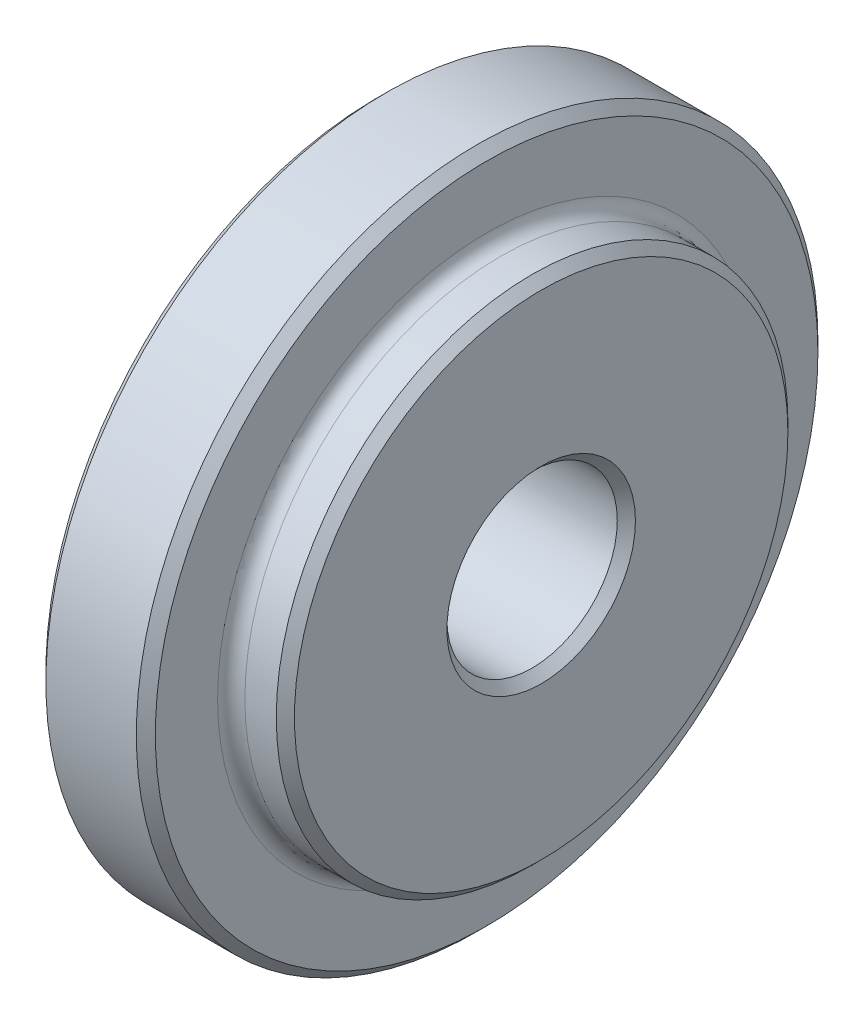
ISO-10303-21;
HEADER;
FILE_DESCRIPTION(('STEP AP214'),'2;1');
FILE_NAME('part.step','',(''),(''),'','','');
FILE_SCHEMA(('AUTOMOTIVE_DESIGN { 1 0 10303 214 1 1 1 1 }'));
ENDSEC;
DATA;
#1=APPLICATION_CONTEXT('core data for automotive mechanical design processes');
#2=APPLICATION_PROTOCOL_DEFINITION('international standard','automotive_design',2000,#1);
#3=PRODUCT_CONTEXT('',#1,'mechanical');
#4=PRODUCT('Part','Part','',(#3));
#5=PRODUCT_RELATED_PRODUCT_CATEGORY('part','',(#4));
#6=PRODUCT_DEFINITION_FORMATION('','',#4);
#7=PRODUCT_DEFINITION_CONTEXT('part definition',#1,'design');
#8=PRODUCT_DEFINITION('design','',#6,#7);
#9=PRODUCT_DEFINITION_SHAPE('','',#8);
#10=(LENGTH_UNIT() NAMED_UNIT(*) SI_UNIT(.MILLI.,.METRE.));
#11=(NAMED_UNIT(*) PLANE_ANGLE_UNIT() SI_UNIT($,.RADIAN.));
#12=(NAMED_UNIT(*) SI_UNIT($,.STERADIAN.) SOLID_ANGLE_UNIT());
#13=UNCERTAINTY_MEASURE_WITH_UNIT(LENGTH_MEASURE(1.E-05),#10,'distance_accuracy_value','');
#14=(GEOMETRIC_REPRESENTATION_CONTEXT(3) GLOBAL_UNCERTAINTY_ASSIGNED_CONTEXT((#13)) GLOBAL_UNIT_ASSIGNED_CONTEXT((#10,
#11,#12)) REPRESENTATION_CONTEXT('',''));
#15=CARTESIAN_POINT('',(0.,0.,0.));
#16=DIRECTION('',(0.,0.,1.));
#17=DIRECTION('',(1.,0.,0.));
#18=AXIS2_PLACEMENT_3D('',#15,#16,#17);
#19=CARTESIAN_POINT('',(28.0619882889644,36.5592585717899,0.));
#20=DIRECTION('',(1.,0.,0.));
#21=DIRECTION('',(0.,0.,-1.));
#22=AXIS2_PLACEMENT_3D('',#19,#20,#21);
#23=CONICAL_SURFACE('',#22,14.2748,0.809783572570159);
#24=CARTESIAN_POINT('',(27.5539882889645,36.5592585717899,0.));
#25=DIRECTION('',(1.,0.,0.));
#26=DIRECTION('',(0.,0.,-1.));
#27=AXIS2_PLACEMENT_3D('',#24,#25,#26);
#28=CIRCLE('',#27,13.7414);
#29=CARTESIAN_POINT('',(27.5539882889645,36.5592585717899,-13.7414));
#30=VERTEX_POINT('',#29);
#31=EDGE_CURVE('E50',#30,#30,#28,.T.);
#32=ORIENTED_EDGE('',*,*,#31,.T.);
#33=EDGE_LOOP('',(#32));
#34=FACE_BOUND('',#33,.T.);
#35=CARTESIAN_POINT('',(28.0619882889644,36.5592585717899,0.));
#36=DIRECTION('',(1.,0.,0.));
#37=DIRECTION('',(0.,0.,-1.));
#38=AXIS2_PLACEMENT_3D('',#35,#36,#37);
#39=CIRCLE('',#38,14.2748);
#40=CARTESIAN_POINT('',(28.0619882889644,36.5592585717899,-14.2748));
#41=VERTEX_POINT('',#40);
#42=EDGE_CURVE('E83',#41,#41,#39,.T.);
#43=ORIENTED_EDGE('',*,*,#42,.F.);
#44=EDGE_LOOP('',(#43));
#45=FACE_BOUND('',#44,.T.);
#46=ADVANCED_FACE('F30',(#34,#45),#23,.T.);
#47=CARTESIAN_POINT('',(27.5539882889645,50.3006585717899,0.));
#48=DIRECTION('',(-1.,0.,0.));
#49=DIRECTION('',(0.,0.,1.));
#50=AXIS2_PLACEMENT_3D('',#47,#48,#49);
#51=PLANE('',#50);
#52=CARTESIAN_POINT('',(27.5539882889645,36.5592585717899,0.));
#53=DIRECTION('',(-1.,0.,0.));
#54=DIRECTION('',(0.,0.,1.));
#55=AXIS2_PLACEMENT_3D('',#52,#53,#54);
#56=CIRCLE('',#55,5.2705);
#57=CARTESIAN_POINT('',(27.5539882889645,36.5592585717899,5.2705));
#58=VERTEX_POINT('',#57);
#59=EDGE_CURVE('E10',#58,#58,#56,.F.);
#60=ORIENTED_EDGE('',*,*,#59,.T.);
#61=EDGE_LOOP('',(#60));
#62=FACE_BOUND('',#61,.T.);
#63=ORIENTED_EDGE('',*,*,#31,.F.);
#64=EDGE_LOOP('',(#63));
#65=FACE_BOUND('',#64,.T.);
#66=ADVANCED_FACE('F91',(#62,#65),#51,.T.);
#67=CARTESIAN_POINT('',(39.7459882889645,50.35145857179,0.));
#68=DIRECTION('',(1.,0.,0.));
#69=DIRECTION('',(0.,0.,-1.));
#70=AXIS2_PLACEMENT_3D('',#67,#68,#69);
#71=PLANE('',#70);
#72=CARTESIAN_POINT('',(39.7459882889645,36.5592585717899,0.));
#73=DIRECTION('',(1.,0.,0.));
#74=DIRECTION('',(0.,0.,-1.));
#75=AXIS2_PLACEMENT_3D('',#72,#73,#74);
#76=CIRCLE('',#75,5.2705);
#77=CARTESIAN_POINT('',(39.7459882889645,36.5592585717899,-5.2705));
#78=VERTEX_POINT('',#77);
#79=EDGE_CURVE('E45',#78,#78,#76,.F.);
#80=ORIENTED_EDGE('',*,*,#79,.T.);
#81=EDGE_LOOP('',(#80));
#82=FACE_BOUND('',#81,.T.);
#83=CARTESIAN_POINT('',(39.7459882889645,36.5592585717899,0.));
#84=DIRECTION('',(1.,0.,0.));
#85=DIRECTION('',(0.,0.,-1.));
#86=AXIS2_PLACEMENT_3D('',#83,#84,#85);
#87=CIRCLE('',#86,13.7922);
#88=CARTESIAN_POINT('',(39.7459882889645,36.5592585717899,-13.7922));
#89=VERTEX_POINT('',#88);
#90=EDGE_CURVE('E53',#89,#89,#87,.T.);
#91=ORIENTED_EDGE('',*,*,#90,.T.);
#92=EDGE_LOOP('',(#91));
#93=FACE_BOUND('',#92,.T.);
#94=ADVANCED_FACE('F97',(#82,#93),#71,.T.);
#95=CARTESIAN_POINT('',(39.7459882889645,36.5592585717899,0.));
#96=DIRECTION('',(-1.,0.,0.));
#97=DIRECTION('',(0.,0.,1.));
#98=AXIS2_PLACEMENT_3D('',#95,#96,#97);
#99=CONICAL_SURFACE('',#98,13.7922,0.785398163397448);
#100=CARTESIAN_POINT('',(39.2379882889645,36.5592585717899,0.));
#101=DIRECTION('',(1.,0.,0.));
#102=DIRECTION('',(0.,0.,-1.));
#103=AXIS2_PLACEMENT_3D('',#100,#101,#102);
#104=CIRCLE('',#103,14.3002);
#105=CARTESIAN_POINT('',(39.2379882889645,36.5592585717899,-14.3002));
#106=VERTEX_POINT('',#105);
#107=EDGE_CURVE('E56',#106,#106,#104,.T.);
#108=ORIENTED_EDGE('',*,*,#107,.T.);
#109=EDGE_LOOP('',(#108));
#110=FACE_BOUND('',#109,.T.);
#111=ORIENTED_EDGE('',*,*,#90,.F.);
#112=EDGE_LOOP('',(#111));
#113=FACE_BOUND('',#112,.T.);
#114=ADVANCED_FACE('F115',(#110,#113),#99,.T.);
#115=CARTESIAN_POINT('',(33.638296361805,36.5592585717899,0.));
#116=DIRECTION('',(1.,0.,0.));
#117=DIRECTION('',(0.,0.,-1.));
#118=AXIS2_PLACEMENT_3D('',#115,#116,#117);
#119=CYLINDRICAL_SURFACE('',#118,14.3002);
#120=CARTESIAN_POINT('',(37.4832169529692,36.5592585717899,0.));
#121=DIRECTION('',(1.,0.,0.));
#122=DIRECTION('',(0.,0.,-1.));
#123=AXIS2_PLACEMENT_3D('',#120,#121,#122);
#124=CIRCLE('',#123,14.3002);
#125=CARTESIAN_POINT('',(37.4832169529692,36.5592585717899,-14.3002));
#126=VERTEX_POINT('',#125);
#127=EDGE_CURVE('E59',#126,#126,#124,.T.);
#128=ORIENTED_EDGE('',*,*,#127,.T.);
#129=EDGE_LOOP('',(#128));
#130=FACE_BOUND('',#129,.T.);
#131=ORIENTED_EDGE('',*,*,#107,.F.);
#132=EDGE_LOOP('',(#131));
#133=FACE_BOUND('',#132,.T.);
#134=ADVANCED_FACE('F119',(#130,#133),#119,.T.);
#135=CARTESIAN_POINT('',(37.4838756361319,36.5592585717899,0.));
#136=DIRECTION('',(1.,0.,0.));
#137=DIRECTION('',(0.,0.,-1.));
#138=AXIS2_PLACEMENT_3D('',#135,#136,#137);
#139=TOROIDAL_SURFACE('',#138,15.0875997244961,0.787399999999984);
#140=CARTESIAN_POINT('',(36.6979882889644,36.5592585717899,0.));
#141=DIRECTION('',(1.,0.,0.));
#142=DIRECTION('',(0.,0.,-1.));
#143=AXIS2_PLACEMENT_3D('',#140,#141,#142);
#144=CIRCLE('',#143,15.0388161456812);
#145=CARTESIAN_POINT('',(36.6979882889644,36.5592585717899,-15.0388161456812));
#146=VERTEX_POINT('',#145);
#147=EDGE_CURVE('E62',#146,#146,#144,.T.);
#148=ORIENTED_EDGE('',*,*,#147,.T.);
#149=EDGE_LOOP('',(#148));
#150=FACE_BOUND('',#149,.T.);
#151=ORIENTED_EDGE('',*,*,#127,.F.);
#152=EDGE_LOOP('',(#151));
#153=FACE_BOUND('',#152,.T.);
#154=ADVANCED_FACE('F125',(#150,#153),#139,.F.);
#155=CARTESIAN_POINT('',(36.6979882889644,55.0778747174712,0.));
#156=DIRECTION('',(1.,0.,0.));
#157=DIRECTION('',(0.,0.,-1.));
#158=AXIS2_PLACEMENT_3D('',#155,#156,#157);
#159=PLANE('',#158);
#160=CARTESIAN_POINT('',(36.6979882889644,36.5592585717899,0.));
#161=DIRECTION('',(1.,0.,0.));
#162=DIRECTION('',(0.,0.,-1.));
#163=AXIS2_PLACEMENT_3D('',#160,#161,#162);
#164=CIRCLE('',#163,18.5186161456812);
#165=CARTESIAN_POINT('',(36.6979882889644,36.5592585717899,-18.5186161456812));
#166=VERTEX_POINT('',#165);
#167=EDGE_CURVE('E65',#166,#166,#164,.T.);
#168=ORIENTED_EDGE('',*,*,#167,.T.);
#169=EDGE_LOOP('',(#168));
#170=FACE_BOUND('',#169,.T.);
#171=ORIENTED_EDGE('',*,*,#147,.F.);
#172=EDGE_LOOP('',(#171));
#173=FACE_BOUND('',#172,.T.);
#174=ADVANCED_FACE('F131',(#170,#173),#159,.T.);
#175=CARTESIAN_POINT('',(36.6979882889644,36.5592585717899,0.));
#176=DIRECTION('',(-1.,0.,0.));
#177=DIRECTION('',(0.,0.,1.));
#178=AXIS2_PLACEMENT_3D('',#175,#176,#177);
#179=CONICAL_SURFACE('',#178,18.5186161456812,0.785398163397448);
#180=CARTESIAN_POINT('',(36.1666044346457,36.5592585717899,0.));
#181=DIRECTION('',(1.,0.,0.));
#182=DIRECTION('',(0.,0.,-1.));
#183=AXIS2_PLACEMENT_3D('',#180,#181,#182);
#184=CIRCLE('',#183,19.05);
#185=CARTESIAN_POINT('',(36.1666044346457,36.5592585717899,-19.05));
#186=VERTEX_POINT('',#185);
#187=EDGE_CURVE('E68',#186,#186,#184,.T.);
#188=ORIENTED_EDGE('',*,*,#187,.T.);
#189=EDGE_LOOP('',(#188));
#190=FACE_BOUND('',#189,.T.);
#191=ORIENTED_EDGE('',*,*,#167,.F.);
#192=EDGE_LOOP('',(#191));
#193=FACE_BOUND('',#192,.T.);
#194=ADVANCED_FACE('F135',(#190,#193),#179,.T.);
#195=CARTESIAN_POINT('',(33.638296361805,36.5592585717899,0.));
#196=DIRECTION('',(1.,0.,0.));
#197=DIRECTION('',(0.,0.,-1.));
#198=AXIS2_PLACEMENT_3D('',#195,#196,#197);
#199=CYLINDRICAL_SURFACE('',#198,19.05);
#200=CARTESIAN_POINT('',(31.1099882889644,36.5592585717899,0.));
#201=DIRECTION('',(1.,0.,0.));
#202=DIRECTION('',(0.,0.,-1.));
#203=AXIS2_PLACEMENT_3D('',#200,#201,#202);
#204=CIRCLE('',#203,19.05);
#205=CARTESIAN_POINT('',(31.1099882889644,36.5592585717899,-19.05));
#206=VERTEX_POINT('',#205);
#207=EDGE_CURVE('E71',#206,#206,#204,.T.);
#208=ORIENTED_EDGE('',*,*,#207,.T.);
#209=EDGE_LOOP('',(#208));
#210=FACE_BOUND('',#209,.T.);
#211=ORIENTED_EDGE('',*,*,#187,.F.);
#212=EDGE_LOOP('',(#211));
#213=FACE_BOUND('',#212,.T.);
#214=ADVANCED_FACE('F139',(#210,#213),#199,.T.);
#215=CARTESIAN_POINT('',(31.1099882889644,36.5592585717899,0.));
#216=DIRECTION('',(1.,0.,0.));
#217=DIRECTION('',(0.,0.,-1.));
#218=AXIS2_PLACEMENT_3D('',#215,#216,#217);
#219=CONICAL_SURFACE('',#218,19.05,0.785398163397452);
#220=CARTESIAN_POINT('',(30.6019882889644,36.5592585717899,0.));
#221=DIRECTION('',(1.,0.,0.));
#222=DIRECTION('',(0.,0.,-1.));
#223=AXIS2_PLACEMENT_3D('',#220,#221,#222);
#224=CIRCLE('',#223,18.542);
#225=CARTESIAN_POINT('',(30.6019882889644,36.5592585717899,-18.542));
#226=VERTEX_POINT('',#225);
#227=EDGE_CURVE('E74',#226,#226,#224,.T.);
#228=ORIENTED_EDGE('',*,*,#227,.T.);
#229=EDGE_LOOP('',(#228));
#230=FACE_BOUND('',#229,.T.);
#231=ORIENTED_EDGE('',*,*,#207,.F.);
#232=EDGE_LOOP('',(#231));
#233=FACE_BOUND('',#232,.T.);
#234=ADVANCED_FACE('F143',(#230,#233),#219,.T.);
#235=CARTESIAN_POINT('',(30.6019882889644,55.1012585717899,0.));
#236=DIRECTION('',(-1.,0.,0.));
#237=DIRECTION('',(0.,0.,1.));
#238=AXIS2_PLACEMENT_3D('',#235,#236,#237);
#239=PLANE('',#238);
#240=CARTESIAN_POINT('',(30.6019882889644,36.5592585717899,0.));
#241=DIRECTION('',(1.,0.,0.));
#242=DIRECTION('',(0.,0.,-1.));
#243=AXIS2_PLACEMENT_3D('',#240,#241,#242);
#244=CIRCLE('',#243,15.0622);
#245=CARTESIAN_POINT('',(30.6019882889644,36.5592585717899,-15.0622));
#246=VERTEX_POINT('',#245);
#247=EDGE_CURVE('E77',#246,#246,#244,.T.);
#248=ORIENTED_EDGE('',*,*,#247,.T.);
#249=EDGE_LOOP('',(#248));
#250=FACE_BOUND('',#249,.T.);
#251=ORIENTED_EDGE('',*,*,#227,.F.);
#252=EDGE_LOOP('',(#251));
#253=FACE_BOUND('',#252,.T.);
#254=ADVANCED_FACE('F147',(#250,#253),#239,.T.);
#255=CARTESIAN_POINT('',(29.8145882889644,36.5592585717899,0.));
#256=DIRECTION('',(1.,0.,0.));
#257=DIRECTION('',(0.,0.,-1.));
#258=AXIS2_PLACEMENT_3D('',#255,#256,#257);
#259=TOROIDAL_SURFACE('',#258,15.0622,0.787400000000002);
#260=CARTESIAN_POINT('',(29.8145882889644,36.5592585717899,0.));
#261=DIRECTION('',(1.,0.,0.));
#262=DIRECTION('',(0.,0.,-1.));
#263=AXIS2_PLACEMENT_3D('',#260,#261,#262);
#264=CIRCLE('',#263,14.2748);
#265=CARTESIAN_POINT('',(29.8145882889644,36.5592585717899,-14.2748));
#266=VERTEX_POINT('',#265);
#267=EDGE_CURVE('E80',#266,#266,#264,.T.);
#268=ORIENTED_EDGE('',*,*,#267,.T.);
#269=EDGE_LOOP('',(#268));
#270=FACE_BOUND('',#269,.T.);
#271=ORIENTED_EDGE('',*,*,#247,.F.);
#272=EDGE_LOOP('',(#271));
#273=FACE_BOUND('',#272,.T.);
#274=ADVANCED_FACE('F151',(#270,#273),#259,.F.);
#275=CARTESIAN_POINT('',(33.638296361805,36.5592585717899,0.));
#276=DIRECTION('',(1.,0.,0.));
#277=DIRECTION('',(0.,0.,-1.));
#278=AXIS2_PLACEMENT_3D('',#275,#276,#277);
#279=CYLINDRICAL_SURFACE('',#278,14.2748);
#280=ORIENTED_EDGE('',*,*,#42,.T.);
#281=EDGE_LOOP('',(#280));
#282=FACE_BOUND('',#281,.T.);
#283=ORIENTED_EDGE('',*,*,#267,.F.);
#284=EDGE_LOOP('',(#283));
#285=FACE_BOUND('',#284,.T.);
#286=ADVANCED_FACE('F87',(#282,#285),#279,.T.);
#287=CARTESIAN_POINT('',(39.7459882889645,36.5592585717899,0.));
#288=DIRECTION('',(-1.,0.,0.));
#289=DIRECTION('',(0.,0.,1.));
#290=AXIS2_PLACEMENT_3D('',#287,#288,#289);
#291=CYLINDRICAL_SURFACE('',#290,4.7625);
#292=CARTESIAN_POINT('',(39.2379882889645,36.5592585717899,0.));
#293=DIRECTION('',(1.,0.,0.));
#294=DIRECTION('',(0.,0.,-1.));
#295=AXIS2_PLACEMENT_3D('',#292,#293,#294);
#296=CIRCLE('',#295,4.7625);
#297=CARTESIAN_POINT('',(39.2379882889645,36.5592585717899,-4.7625));
#298=VERTEX_POINT('',#297);
#299=EDGE_CURVE('E37',#298,#298,#296,.T.);
#300=ORIENTED_EDGE('',*,*,#299,.T.);
#301=EDGE_LOOP('',(#300));
#302=FACE_BOUND('',#301,.T.);
#303=CARTESIAN_POINT('',(28.0619882889645,36.5592585717899,0.));
#304=DIRECTION('',(-1.,0.,0.));
#305=DIRECTION('',(0.,0.,1.));
#306=AXIS2_PLACEMENT_3D('',#303,#304,#305);
#307=CIRCLE('',#306,4.7625);
#308=CARTESIAN_POINT('',(28.0619882889645,36.5592585717899,4.7625));
#309=VERTEX_POINT('',#308);
#310=EDGE_CURVE('E41',#309,#309,#307,.T.);
#311=ORIENTED_EDGE('',*,*,#310,.T.);
#312=EDGE_LOOP('',(#311));
#313=FACE_BOUND('',#312,.T.);
#314=ADVANCED_FACE('F102',(#302,#313),#291,.F.);
#315=CARTESIAN_POINT('',(39.7459882889645,36.5592585717899,0.));
#316=DIRECTION('',(1.,0.,0.));
#317=DIRECTION('',(0.,0.,-1.));
#318=AXIS2_PLACEMENT_3D('',#315,#316,#317);
#319=CONICAL_SURFACE('',#318,5.2705,0.78539816339745);
#320=ORIENTED_EDGE('',*,*,#299,.F.);
#321=EDGE_LOOP('',(#320));
#322=FACE_BOUND('',#321,.T.);
#323=ORIENTED_EDGE('',*,*,#79,.F.);
#324=EDGE_LOOP('',(#323));
#325=FACE_BOUND('',#324,.T.);
#326=ADVANCED_FACE('F100',(#322,#325),#319,.F.);
#327=CARTESIAN_POINT('',(28.0619882889645,36.5592585717899,0.));
#328=DIRECTION('',(-1.,0.,0.));
#329=DIRECTION('',(0.,0.,1.));
#330=AXIS2_PLACEMENT_3D('',#327,#328,#329);
#331=CONICAL_SURFACE('',#330,4.7625,0.78539816339745);
#332=ORIENTED_EDGE('',*,*,#59,.F.);
#333=EDGE_LOOP('',(#332));
#334=FACE_BOUND('',#333,.T.);
#335=ORIENTED_EDGE('',*,*,#310,.F.);
#336=EDGE_LOOP('',(#335));
#337=FACE_BOUND('',#336,.T.);
#338=ADVANCED_FACE('F32',(#334,#337),#331,.F.);
#339=CLOSED_SHELL('',(#46,#66,#94,#114,#134,#154,#174,#194,#214,#234,#254,#274,#286,#314,#326,#338));
#340=MANIFOLD_SOLID_BREP('B2',#339);
#341=ADVANCED_BREP_SHAPE_REPRESENTATION('',(#18,#340),#14);
#342=SHAPE_DEFINITION_REPRESENTATION(#9,#341);
ENDSEC;
END-ISO-10303-21;
